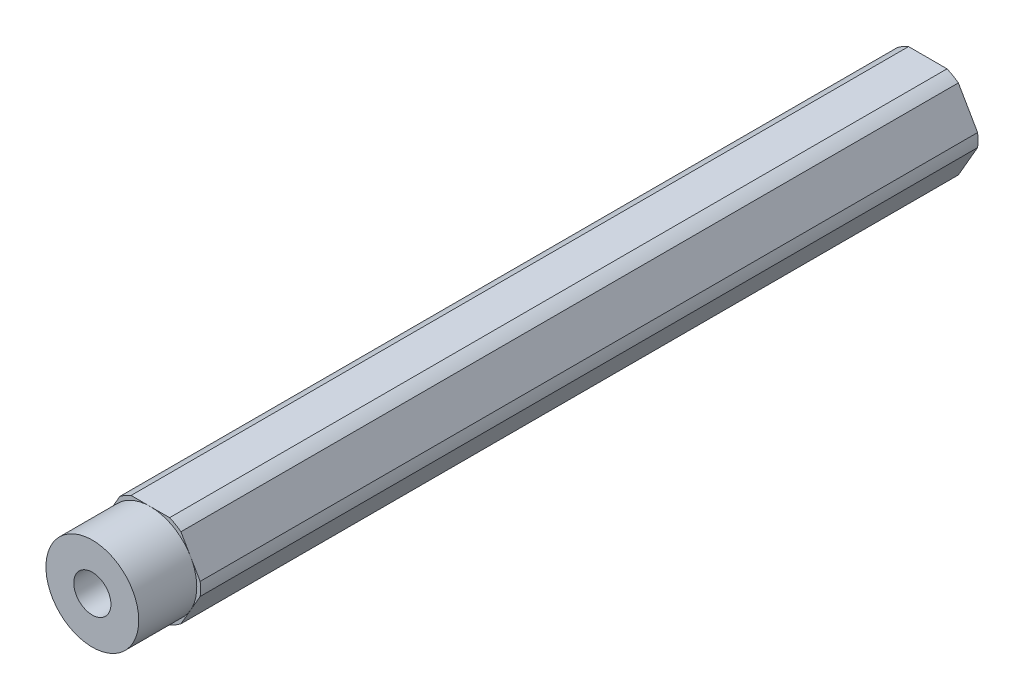
ISO-10303-21;
HEADER;
FILE_DESCRIPTION(('STEP AP214'),'2;1');
FILE_NAME('part.step','',(''),(''),'','','');
FILE_SCHEMA(('AUTOMOTIVE_DESIGN { 1 0 10303 214 1 1 1 1 }'));
ENDSEC;
DATA;
#1=APPLICATION_CONTEXT('core data for automotive mechanical design processes');
#2=APPLICATION_PROTOCOL_DEFINITION('international standard','automotive_design',2000,#1);
#3=PRODUCT_CONTEXT('',#1,'mechanical');
#4=PRODUCT('Part','Part','',(#3));
#5=PRODUCT_RELATED_PRODUCT_CATEGORY('part','',(#4));
#6=PRODUCT_DEFINITION_FORMATION('','',#4);
#7=PRODUCT_DEFINITION_CONTEXT('part definition',#1,'design');
#8=PRODUCT_DEFINITION('design','',#6,#7);
#9=PRODUCT_DEFINITION_SHAPE('','',#8);
#10=(LENGTH_UNIT() NAMED_UNIT(*) SI_UNIT(.MILLI.,.METRE.));
#11=(NAMED_UNIT(*) PLANE_ANGLE_UNIT() SI_UNIT($,.RADIAN.));
#12=(NAMED_UNIT(*) SI_UNIT($,.STERADIAN.) SOLID_ANGLE_UNIT());
#13=UNCERTAINTY_MEASURE_WITH_UNIT(LENGTH_MEASURE(1.E-05),#10,'distance_accuracy_value','');
#14=(GEOMETRIC_REPRESENTATION_CONTEXT(3) GLOBAL_UNCERTAINTY_ASSIGNED_CONTEXT((#13)) GLOBAL_UNIT_ASSIGNED_CONTEXT((#10,
#11,#12)) REPRESENTATION_CONTEXT('',''));
#15=CARTESIAN_POINT('',(0.,0.,0.));
#16=DIRECTION('',(0.,0.,1.));
#17=DIRECTION('',(1.,0.,0.));
#18=AXIS2_PLACEMENT_3D('',#15,#16,#17);
#19=CARTESIAN_POINT('',(0.,0.,114.3));
#20=DIRECTION('',(0.,0.,1.));
#21=DIRECTION('',(1.,0.,0.));
#22=AXIS2_PLACEMENT_3D('',#19,#20,#21);
#23=PLANE('',#22);
#24=CARTESIAN_POINT('',(0.,0.,114.3));
#25=DIRECTION('',(0.,0.,1.));
#26=DIRECTION('',(1.,0.,0.));
#27=AXIS2_PLACEMENT_3D('',#24,#25,#26);
#28=CIRCLE('',#27,2.54);
#29=CARTESIAN_POINT('',(2.54,0.,114.3));
#30=VERTEX_POINT('',#29);
#31=EDGE_CURVE('E178',#30,#30,#28,.T.);
#32=ORIENTED_EDGE('',*,*,#31,.F.);
#33=EDGE_LOOP('',(#32));
#34=FACE_BOUND('',#33,.T.);
#35=CARTESIAN_POINT('',(0.,0.,114.3));
#36=DIRECTION('',(0.,0.,1.));
#37=DIRECTION('',(1.,0.,0.));
#38=AXIS2_PLACEMENT_3D('',#35,#36,#37);
#39=CIRCLE('',#38,6.35);
#40=CARTESIAN_POINT('',(6.35,0.,114.3));
#41=VERTEX_POINT('',#40);
#42=EDGE_CURVE('E275',#41,#41,#39,.T.);
#43=ORIENTED_EDGE('',*,*,#42,.T.);
#44=EDGE_LOOP('',(#43));
#45=FACE_BOUND('',#44,.T.);
#46=ADVANCED_FACE('F34',(#34,#45),#23,.T.);
#47=CARTESIAN_POINT('',(0.,0.,114.3));
#48=DIRECTION('',(0.,0.,-1.));
#49=DIRECTION('',(-1.,0.,0.));
#50=AXIS2_PLACEMENT_3D('',#47,#48,#49);
#51=CYLINDRICAL_SURFACE('',#50,6.875);
#52=CARTESIAN_POINT('',(0.,0.,106.3625));
#53=DIRECTION('',(0.,0.,1.));
#54=DIRECTION('',(1.,0.,0.));
#55=AXIS2_PLACEMENT_3D('',#52,#53,#54);
#56=CIRCLE('',#55,6.875);
#57=CARTESIAN_POINT('',(4.18177080173139,5.4569605057932,106.3625));
#58=VERTEX_POINT('',#57);
#59=CARTESIAN_POINT('',(2.6349810245996,6.35,106.3625));
#60=VERTEX_POINT('',#59);
#61=EDGE_CURVE('E144',#58,#60,#56,.T.);
#62=ORIENTED_EDGE('',*,*,#61,.F.);
#63=DIRECTION('',(0.,0.,-1.));
#64=VECTOR('',#63,1.);
#65=CARTESIAN_POINT('',(4.18177080173138,5.45696050579321,114.3));
#66=LINE('',#65,#64);
#67=CARTESIAN_POINT('',(4.18177080173138,5.45696050579321,0.));
#68=VERTEX_POINT('',#67);
#69=EDGE_CURVE('E57',#58,#68,#66,.T.);
#70=ORIENTED_EDGE('',*,*,#69,.T.);
#71=CARTESIAN_POINT('',(0.,0.,0.));
#72=DIRECTION('',(0.,0.,1.));
#73=DIRECTION('',(1.,0.,0.));
#74=AXIS2_PLACEMENT_3D('',#71,#72,#73);
#75=CIRCLE('',#74,6.875);
#76=CARTESIAN_POINT('',(2.6349810245996,6.35,0.));
#77=VERTEX_POINT('',#76);
#78=EDGE_CURVE('E181',#68,#77,#75,.T.);
#79=ORIENTED_EDGE('',*,*,#78,.T.);
#80=DIRECTION('',(0.,0.,-1.));
#81=VECTOR('',#80,1.);
#82=CARTESIAN_POINT('',(2.6349810245996,6.35,114.3));
#83=LINE('',#82,#81);
#84=EDGE_CURVE('E235',#60,#77,#83,.T.);
#85=ORIENTED_EDGE('',*,*,#84,.F.);
#86=EDGE_LOOP('',(#62,#70,#79,#85));
#87=FACE_BOUND('',#86,.T.);
#88=ADVANCED_FACE('F36',(#87),#51,.T.);
#89=CARTESIAN_POINT('',(2.6349810245996,6.35,114.3));
#90=DIRECTION('',(0.,-1.,0.));
#91=DIRECTION('',(0.,0.,-1.));
#92=AXIS2_PLACEMENT_3D('',#89,#90,#91);
#93=PLANE('',#92);
#94=DIRECTION('',(-1.,0.,0.));
#95=VECTOR('',#94,1.);
#96=CARTESIAN_POINT('',(2.6349810245996,6.35,106.3625));
#97=LINE('',#96,#95);
#98=CARTESIAN_POINT('',(0.,6.35,106.3625));
#99=VERTEX_POINT('',#98);
#100=EDGE_CURVE('E141',#60,#99,#97,.T.);
#101=ORIENTED_EDGE('',*,*,#100,.F.);
#102=ORIENTED_EDGE('',*,*,#84,.T.);
#103=DIRECTION('',(-1.,0.,0.));
#104=VECTOR('',#103,1.);
#105=CARTESIAN_POINT('',(2.6349810245996,6.35,0.));
#106=LINE('',#105,#104);
#107=CARTESIAN_POINT('',(-2.6349810245996,6.35,0.));
#108=VERTEX_POINT('',#107);
#109=EDGE_CURVE('E185',#77,#108,#106,.T.);
#110=ORIENTED_EDGE('',*,*,#109,.T.);
#111=DIRECTION('',(0.,0.,-1.));
#112=VECTOR('',#111,1.);
#113=CARTESIAN_POINT('',(-2.6349810245996,6.35,114.3));
#114=LINE('',#113,#112);
#115=CARTESIAN_POINT('',(-2.6349810245996,6.35,106.3625));
#116=VERTEX_POINT('',#115);
#117=EDGE_CURVE('E171',#116,#108,#114,.T.);
#118=ORIENTED_EDGE('',*,*,#117,.F.);
#119=EDGE_CURVE('E148',#99,#116,#97,.T.);
#120=ORIENTED_EDGE('',*,*,#119,.F.);
#121=EDGE_LOOP('',(#101,#102,#110,#118,#120));
#122=FACE_BOUND('',#121,.T.);
#123=ADVANCED_FACE('F169',(#122),#93,.F.);
#124=CARTESIAN_POINT('',(0.,0.,114.3));
#125=DIRECTION('',(0.,0.,-1.));
#126=DIRECTION('',(-1.,0.,0.));
#127=AXIS2_PLACEMENT_3D('',#124,#125,#126);
#128=CYLINDRICAL_SURFACE('',#127,6.875);
#129=CARTESIAN_POINT('',(0.,0.,106.3625));
#130=DIRECTION('',(0.,0.,1.));
#131=DIRECTION('',(1.,0.,0.));
#132=AXIS2_PLACEMENT_3D('',#129,#130,#131);
#133=CIRCLE('',#132,6.875);
#134=CARTESIAN_POINT('',(-4.18177080173139,5.4569605057932,106.3625));
#135=VERTEX_POINT('',#134);
#136=EDGE_CURVE('E172',#116,#135,#133,.T.);
#137=ORIENTED_EDGE('',*,*,#136,.F.);
#138=ORIENTED_EDGE('',*,*,#117,.T.);
#139=CARTESIAN_POINT('',(0.,0.,0.));
#140=DIRECTION('',(0.,0.,1.));
#141=DIRECTION('',(1.,0.,0.));
#142=AXIS2_PLACEMENT_3D('',#139,#140,#141);
#143=CIRCLE('',#142,6.875);
#144=CARTESIAN_POINT('',(-4.18177080173139,5.4569605057932,0.));
#145=VERTEX_POINT('',#144);
#146=EDGE_CURVE('E187',#108,#145,#143,.T.);
#147=ORIENTED_EDGE('',*,*,#146,.T.);
#148=DIRECTION('',(0.,0.,-1.));
#149=VECTOR('',#148,1.);
#150=CARTESIAN_POINT('',(-4.18177080173139,5.4569605057932,114.3));
#151=LINE('',#150,#149);
#152=EDGE_CURVE('E233',#135,#145,#151,.T.);
#153=ORIENTED_EDGE('',*,*,#152,.F.);
#154=EDGE_LOOP('',(#137,#138,#147,#153));
#155=FACE_BOUND('',#154,.T.);
#156=ADVANCED_FACE('F253',(#155),#128,.T.);
#157=CARTESIAN_POINT('',(-4.18177080173139,5.4569605057932,114.3));
#158=DIRECTION('',(0.866025403784438,-0.5,0.));
#159=DIRECTION('',(0.5,0.866025403784439,0.));
#160=AXIS2_PLACEMENT_3D('',#157,#158,#159);
#161=PLANE('',#160);
#162=DIRECTION('',(-0.5,-0.866025403784439,0.));
#163=VECTOR('',#162,1.);
#164=CARTESIAN_POINT('',(-4.18177080173139,5.4569605057932,106.3625));
#165=LINE('',#164,#163);
#166=CARTESIAN_POINT('',(-5.49926131403118,3.175,106.3625));
#167=VERTEX_POINT('',#166);
#168=EDGE_CURVE('E156',#135,#167,#165,.T.);
#169=ORIENTED_EDGE('',*,*,#168,.F.);
#170=ORIENTED_EDGE('',*,*,#152,.T.);
#171=DIRECTION('',(-0.5,-0.866025403784438,0.));
#172=VECTOR('',#171,1.);
#173=CARTESIAN_POINT('',(-4.18177080173139,5.4569605057932,0.));
#174=LINE('',#173,#172);
#175=CARTESIAN_POINT('',(-6.81675182633099,0.893039494206804,0.));
#176=VERTEX_POINT('',#175);
#177=EDGE_CURVE('E190',#145,#176,#174,.T.);
#178=ORIENTED_EDGE('',*,*,#177,.T.);
#179=DIRECTION('',(0.,0.,-1.));
#180=VECTOR('',#179,1.);
#181=CARTESIAN_POINT('',(-6.81675182633099,0.893039494206804,114.3));
#182=LINE('',#181,#180);
#183=CARTESIAN_POINT('',(-6.81675182633099,0.893039494206804,106.3625));
#184=VERTEX_POINT('',#183);
#185=EDGE_CURVE('E231',#184,#176,#182,.T.);
#186=ORIENTED_EDGE('',*,*,#185,.F.);
#187=EDGE_CURVE('E257',#167,#184,#165,.T.);
#188=ORIENTED_EDGE('',*,*,#187,.F.);
#189=EDGE_LOOP('',(#169,#170,#178,#186,#188));
#190=FACE_BOUND('',#189,.T.);
#191=ADVANCED_FACE('F255',(#190),#161,.F.);
#192=CARTESIAN_POINT('',(0.,0.,114.3));
#193=DIRECTION('',(0.,0.,-1.));
#194=DIRECTION('',(-1.,0.,0.));
#195=AXIS2_PLACEMENT_3D('',#192,#193,#194);
#196=CYLINDRICAL_SURFACE('',#195,6.875);
#197=CARTESIAN_POINT('',(0.,0.,106.3625));
#198=DIRECTION('',(0.,0.,1.));
#199=DIRECTION('',(1.,0.,0.));
#200=AXIS2_PLACEMENT_3D('',#197,#198,#199);
#201=CIRCLE('',#200,6.875);
#202=CARTESIAN_POINT('',(-6.81675182633099,-0.893039494206803,106.3625));
#203=VERTEX_POINT('',#202);
#204=EDGE_CURVE('E258',#184,#203,#201,.T.);
#205=ORIENTED_EDGE('',*,*,#204,.F.);
#206=ORIENTED_EDGE('',*,*,#185,.T.);
#207=CARTESIAN_POINT('',(0.,0.,0.));
#208=DIRECTION('',(0.,0.,1.));
#209=DIRECTION('',(1.,0.,0.));
#210=AXIS2_PLACEMENT_3D('',#207,#208,#209);
#211=CIRCLE('',#210,6.875);
#212=CARTESIAN_POINT('',(-6.81675182633099,-0.893039494206803,0.));
#213=VERTEX_POINT('',#212);
#214=EDGE_CURVE('E193',#176,#213,#211,.T.);
#215=ORIENTED_EDGE('',*,*,#214,.T.);
#216=DIRECTION('',(0.,0.,-1.));
#217=VECTOR('',#216,1.);
#218=CARTESIAN_POINT('',(-6.81675182633099,-0.893039494206803,114.3));
#219=LINE('',#218,#217);
#220=EDGE_CURVE('E229',#203,#213,#219,.T.);
#221=ORIENTED_EDGE('',*,*,#220,.F.);
#222=EDGE_LOOP('',(#205,#206,#215,#221));
#223=FACE_BOUND('',#222,.T.);
#224=ADVANCED_FACE('F446',(#223),#196,.T.);
#225=CARTESIAN_POINT('',(-6.81675182633099,-0.893039494206804,114.3));
#226=DIRECTION('',(0.866025403784439,0.5,0.));
#227=DIRECTION('',(-0.5,0.866025403784439,0.));
#228=AXIS2_PLACEMENT_3D('',#225,#226,#227);
#229=PLANE('',#228);
#230=DIRECTION('',(0.5,-0.866025403784439,0.));
#231=VECTOR('',#230,1.);
#232=CARTESIAN_POINT('',(-6.81675182633099,-0.893039494206804,106.3625));
#233=LINE('',#232,#231);
#234=CARTESIAN_POINT('',(-5.49926131403119,-3.175,106.3625));
#235=VERTEX_POINT('',#234);
#236=EDGE_CURVE('E261',#203,#235,#233,.T.);
#237=ORIENTED_EDGE('',*,*,#236,.F.);
#238=ORIENTED_EDGE('',*,*,#220,.T.);
#239=DIRECTION('',(0.5,-0.866025403784439,0.));
#240=VECTOR('',#239,1.);
#241=CARTESIAN_POINT('',(-6.81675182633099,-0.893039494206804,0.));
#242=LINE('',#241,#240);
#243=CARTESIAN_POINT('',(-4.18177080173139,-5.4569605057932,0.));
#244=VERTEX_POINT('',#243);
#245=EDGE_CURVE('E196',#213,#244,#242,.T.);
#246=ORIENTED_EDGE('',*,*,#245,.T.);
#247=DIRECTION('',(0.,0.,-1.));
#248=VECTOR('',#247,1.);
#249=CARTESIAN_POINT('',(-4.18177080173139,-5.4569605057932,114.3));
#250=LINE('',#249,#248);
#251=CARTESIAN_POINT('',(-4.18177080173139,-5.4569605057932,106.3625));
#252=VERTEX_POINT('',#251);
#253=EDGE_CURVE('E227',#252,#244,#250,.T.);
#254=ORIENTED_EDGE('',*,*,#253,.F.);
#255=EDGE_CURVE('E262',#235,#252,#233,.T.);
#256=ORIENTED_EDGE('',*,*,#255,.F.);
#257=EDGE_LOOP('',(#237,#238,#246,#254,#256));
#258=FACE_BOUND('',#257,.T.);
#259=ADVANCED_FACE('F291',(#258),#229,.F.);
#260=CARTESIAN_POINT('',(0.,0.,114.3));
#261=DIRECTION('',(0.,0.,-1.));
#262=DIRECTION('',(-1.,0.,0.));
#263=AXIS2_PLACEMENT_3D('',#260,#261,#262);
#264=CYLINDRICAL_SURFACE('',#263,6.875);
#265=CARTESIAN_POINT('',(0.,0.,106.3625));
#266=DIRECTION('',(0.,0.,1.));
#267=DIRECTION('',(1.,0.,0.));
#268=AXIS2_PLACEMENT_3D('',#265,#266,#267);
#269=CIRCLE('',#268,6.875);
#270=CARTESIAN_POINT('',(-2.6349810245996,-6.35,106.3625));
#271=VERTEX_POINT('',#270);
#272=EDGE_CURVE('E264',#252,#271,#269,.T.);
#273=ORIENTED_EDGE('',*,*,#272,.F.);
#274=ORIENTED_EDGE('',*,*,#253,.T.);
#275=CARTESIAN_POINT('',(0.,0.,0.));
#276=DIRECTION('',(0.,0.,1.));
#277=DIRECTION('',(1.,0.,0.));
#278=AXIS2_PLACEMENT_3D('',#275,#276,#277);
#279=CIRCLE('',#278,6.875);
#280=CARTESIAN_POINT('',(-2.6349810245996,-6.35,0.));
#281=VERTEX_POINT('',#280);
#282=EDGE_CURVE('E199',#244,#281,#279,.T.);
#283=ORIENTED_EDGE('',*,*,#282,.T.);
#284=DIRECTION('',(0.,0.,-1.));
#285=VECTOR('',#284,1.);
#286=CARTESIAN_POINT('',(-2.6349810245996,-6.35,114.3));
#287=LINE('',#286,#285);
#288=EDGE_CURVE('E225',#271,#281,#287,.T.);
#289=ORIENTED_EDGE('',*,*,#288,.F.);
#290=EDGE_LOOP('',(#273,#274,#283,#289));
#291=FACE_BOUND('',#290,.T.);
#292=ADVANCED_FACE('F299',(#291),#264,.T.);
#293=CARTESIAN_POINT('',(-2.6349810245996,-6.35,114.3));
#294=DIRECTION('',(0.,1.,0.));
#295=DIRECTION('',(-1.,0.,0.));
#296=AXIS2_PLACEMENT_3D('',#293,#294,#295);
#297=PLANE('',#296);
#298=DIRECTION('',(1.,0.,0.));
#299=VECTOR('',#298,1.);
#300=CARTESIAN_POINT('',(-2.6349810245996,-6.35,106.3625));
#301=LINE('',#300,#299);
#302=CARTESIAN_POINT('',(0.,-6.35,106.3625));
#303=VERTEX_POINT('',#302);
#304=EDGE_CURVE('E266',#271,#303,#301,.T.);
#305=ORIENTED_EDGE('',*,*,#304,.F.);
#306=ORIENTED_EDGE('',*,*,#288,.T.);
#307=DIRECTION('',(1.,0.,0.));
#308=VECTOR('',#307,1.);
#309=CARTESIAN_POINT('',(-2.6349810245996,-6.35,0.));
#310=LINE('',#309,#308);
#311=CARTESIAN_POINT('',(2.6349810245996,-6.35,0.));
#312=VERTEX_POINT('',#311);
#313=EDGE_CURVE('E202',#281,#312,#310,.T.);
#314=ORIENTED_EDGE('',*,*,#313,.T.);
#315=DIRECTION('',(0.,0.,-1.));
#316=VECTOR('',#315,1.);
#317=CARTESIAN_POINT('',(2.6349810245996,-6.35,114.3));
#318=LINE('',#317,#316);
#319=CARTESIAN_POINT('',(2.6349810245996,-6.35,106.3625));
#320=VERTEX_POINT('',#319);
#321=EDGE_CURVE('E223',#320,#312,#318,.T.);
#322=ORIENTED_EDGE('',*,*,#321,.F.);
#323=EDGE_CURVE('E267',#303,#320,#301,.T.);
#324=ORIENTED_EDGE('',*,*,#323,.F.);
#325=EDGE_LOOP('',(#305,#306,#314,#322,#324));
#326=FACE_BOUND('',#325,.T.);
#327=ADVANCED_FACE('F303',(#326),#297,.F.);
#328=CARTESIAN_POINT('',(0.,0.,114.3));
#329=DIRECTION('',(0.,0.,-1.));
#330=DIRECTION('',(-1.,0.,0.));
#331=AXIS2_PLACEMENT_3D('',#328,#329,#330);
#332=CYLINDRICAL_SURFACE('',#331,6.875);
#333=CARTESIAN_POINT('',(0.,0.,106.3625));
#334=DIRECTION('',(0.,0.,1.));
#335=DIRECTION('',(1.,0.,0.));
#336=AXIS2_PLACEMENT_3D('',#333,#334,#335);
#337=CIRCLE('',#336,6.875);
#338=CARTESIAN_POINT('',(4.18177080173138,-5.45696050579321,106.3625));
#339=VERTEX_POINT('',#338);
#340=EDGE_CURVE('E269',#320,#339,#337,.T.);
#341=ORIENTED_EDGE('',*,*,#340,.F.);
#342=ORIENTED_EDGE('',*,*,#321,.T.);
#343=CARTESIAN_POINT('',(0.,0.,0.));
#344=DIRECTION('',(0.,0.,1.));
#345=DIRECTION('',(1.,0.,0.));
#346=AXIS2_PLACEMENT_3D('',#343,#344,#345);
#347=CIRCLE('',#346,6.875);
#348=CARTESIAN_POINT('',(4.18177080173138,-5.45696050579321,0.));
#349=VERTEX_POINT('',#348);
#350=EDGE_CURVE('E205',#312,#349,#347,.T.);
#351=ORIENTED_EDGE('',*,*,#350,.T.);
#352=DIRECTION('',(0.,0.,-1.));
#353=VECTOR('',#352,1.);
#354=CARTESIAN_POINT('',(4.18177080173138,-5.45696050579321,114.3));
#355=LINE('',#354,#353);
#356=EDGE_CURVE('E221',#339,#349,#355,.T.);
#357=ORIENTED_EDGE('',*,*,#356,.F.);
#358=EDGE_LOOP('',(#341,#342,#351,#357));
#359=FACE_BOUND('',#358,.T.);
#360=ADVANCED_FACE('F321',(#359),#332,.T.);
#361=CARTESIAN_POINT('',(4.18177080173138,-5.45696050579321,114.3));
#362=DIRECTION('',(-0.866025403784438,0.500000000000001,0.));
#363=DIRECTION('',(-0.500000000000001,-0.866025403784438,0.));
#364=AXIS2_PLACEMENT_3D('',#361,#362,#363);
#365=PLANE('',#364);
#366=DIRECTION('',(0.500000000000001,0.866025403784438,0.));
#367=VECTOR('',#366,1.);
#368=CARTESIAN_POINT('',(4.18177080173138,-5.45696050579321,106.3625));
#369=LINE('',#368,#367);
#370=CARTESIAN_POINT('',(5.49926131403118,-3.175,106.3625));
#371=VERTEX_POINT('',#370);
#372=EDGE_CURVE('E271',#339,#371,#369,.T.);
#373=ORIENTED_EDGE('',*,*,#372,.F.);
#374=ORIENTED_EDGE('',*,*,#356,.T.);
#375=DIRECTION('',(0.500000000000001,0.866025403784438,0.));
#376=VECTOR('',#375,1.);
#377=CARTESIAN_POINT('',(4.18177080173138,-5.45696050579321,0.));
#378=LINE('',#377,#376);
#379=CARTESIAN_POINT('',(6.81675182633099,-0.893039494206801,0.));
#380=VERTEX_POINT('',#379);
#381=EDGE_CURVE('E208',#349,#380,#378,.T.);
#382=ORIENTED_EDGE('',*,*,#381,.T.);
#383=DIRECTION('',(0.,0.,-1.));
#384=VECTOR('',#383,1.);
#385=CARTESIAN_POINT('',(6.81675182633099,-0.893039494206801,114.3));
#386=LINE('',#385,#384);
#387=CARTESIAN_POINT('',(6.81675182633099,-0.893039494206801,106.3625));
#388=VERTEX_POINT('',#387);
#389=EDGE_CURVE('E219',#388,#380,#386,.T.);
#390=ORIENTED_EDGE('',*,*,#389,.F.);
#391=EDGE_CURVE('E272',#371,#388,#369,.T.);
#392=ORIENTED_EDGE('',*,*,#391,.F.);
#393=EDGE_LOOP('',(#373,#374,#382,#390,#392));
#394=FACE_BOUND('',#393,.T.);
#395=ADVANCED_FACE('F319',(#394),#365,.F.);
#396=CARTESIAN_POINT('',(0.,0.,114.3));
#397=DIRECTION('',(0.,0.,-1.));
#398=DIRECTION('',(-1.,0.,0.));
#399=AXIS2_PLACEMENT_3D('',#396,#397,#398);
#400=CYLINDRICAL_SURFACE('',#399,6.875);
#401=CARTESIAN_POINT('',(0.,0.,106.3625));
#402=DIRECTION('',(0.,0.,1.));
#403=DIRECTION('',(1.,0.,0.));
#404=AXIS2_PLACEMENT_3D('',#401,#402,#403);
#405=CIRCLE('',#404,6.875);
#406=CARTESIAN_POINT('',(6.81675182633099,0.893039494206792,106.3625));
#407=VERTEX_POINT('',#406);
#408=EDGE_CURVE('E167',#388,#407,#405,.T.);
#409=ORIENTED_EDGE('',*,*,#408,.F.);
#410=ORIENTED_EDGE('',*,*,#389,.T.);
#411=CARTESIAN_POINT('',(0.,0.,0.));
#412=DIRECTION('',(0.,0.,1.));
#413=DIRECTION('',(1.,0.,0.));
#414=AXIS2_PLACEMENT_3D('',#411,#412,#413);
#415=CIRCLE('',#414,6.875);
#416=CARTESIAN_POINT('',(6.81675182633099,0.893039494206792,0.));
#417=VERTEX_POINT('',#416);
#418=EDGE_CURVE('E211',#380,#417,#415,.T.);
#419=ORIENTED_EDGE('',*,*,#418,.T.);
#420=DIRECTION('',(0.,0.,-1.));
#421=VECTOR('',#420,1.);
#422=CARTESIAN_POINT('',(6.81675182633099,0.893039494206792,114.3));
#423=LINE('',#422,#421);
#424=EDGE_CURVE('E217',#407,#417,#423,.T.);
#425=ORIENTED_EDGE('',*,*,#424,.F.);
#426=EDGE_LOOP('',(#409,#410,#419,#425));
#427=FACE_BOUND('',#426,.T.);
#428=ADVANCED_FACE('F316',(#427),#400,.T.);
#429=CARTESIAN_POINT('',(6.81675182633099,0.893039494206795,114.3));
#430=DIRECTION('',(-0.866025403784439,-0.5,0.));
#431=DIRECTION('',(0.5,-0.866025403784439,0.));
#432=AXIS2_PLACEMENT_3D('',#429,#430,#431);
#433=PLANE('',#432);
#434=DIRECTION('',(-0.5,0.866025403784439,0.));
#435=VECTOR('',#434,1.);
#436=CARTESIAN_POINT('',(6.81675182633099,0.893039494206795,106.3625));
#437=LINE('',#436,#435);
#438=CARTESIAN_POINT('',(5.49926131403118,3.175,106.3625));
#439=VERTEX_POINT('',#438);
#440=EDGE_CURVE('E12',#407,#439,#437,.T.);
#441=ORIENTED_EDGE('',*,*,#440,.F.);
#442=ORIENTED_EDGE('',*,*,#424,.T.);
#443=DIRECTION('',(-0.5,0.866025403784439,0.));
#444=VECTOR('',#443,1.);
#445=CARTESIAN_POINT('',(6.81675182633099,0.893039494206795,0.));
#446=LINE('',#445,#444);
#447=EDGE_CURVE('E214',#417,#68,#446,.T.);
#448=ORIENTED_EDGE('',*,*,#447,.T.);
#449=ORIENTED_EDGE('',*,*,#69,.F.);
#450=EDGE_CURVE('E38',#439,#58,#437,.T.);
#451=ORIENTED_EDGE('',*,*,#450,.F.);
#452=EDGE_LOOP('',(#441,#442,#448,#449,#451));
#453=FACE_BOUND('',#452,.T.);
#454=ADVANCED_FACE('F240',(#453),#433,.F.);
#455=CARTESIAN_POINT('',(0.,0.,0.));
#456=DIRECTION('',(0.,0.,1.));
#457=DIRECTION('',(1.,0.,0.));
#458=AXIS2_PLACEMENT_3D('',#455,#456,#457);
#459=PLANE('',#458);
#460=ORIENTED_EDGE('',*,*,#78,.F.);
#461=ORIENTED_EDGE('',*,*,#447,.F.);
#462=ORIENTED_EDGE('',*,*,#418,.F.);
#463=ORIENTED_EDGE('',*,*,#381,.F.);
#464=ORIENTED_EDGE('',*,*,#350,.F.);
#465=ORIENTED_EDGE('',*,*,#313,.F.);
#466=ORIENTED_EDGE('',*,*,#282,.F.);
#467=ORIENTED_EDGE('',*,*,#245,.F.);
#468=ORIENTED_EDGE('',*,*,#214,.F.);
#469=ORIENTED_EDGE('',*,*,#177,.F.);
#470=ORIENTED_EDGE('',*,*,#146,.F.);
#471=ORIENTED_EDGE('',*,*,#109,.F.);
#472=EDGE_LOOP('',(#460,#461,#462,#463,#464,#465,#466,#467,#468,#469,#470,#471));
#473=FACE_BOUND('',#472,.T.);
#474=CARTESIAN_POINT('',(0.,0.,0.));
#475=DIRECTION('',(0.,0.,1.));
#476=DIRECTION('',(1.,0.,0.));
#477=AXIS2_PLACEMENT_3D('',#474,#475,#476);
#478=CIRCLE('',#477,2.54);
#479=CARTESIAN_POINT('',(2.54,0.,0.));
#480=VERTEX_POINT('',#479);
#481=EDGE_CURVE('E177',#480,#480,#478,.T.);
#482=ORIENTED_EDGE('',*,*,#481,.T.);
#483=EDGE_LOOP('',(#482));
#484=FACE_BOUND('',#483,.T.);
#485=ADVANCED_FACE('F246',(#473,#484),#459,.F.);
#486=CARTESIAN_POINT('',(0.,0.,114.3));
#487=DIRECTION('',(0.,0.,-1.));
#488=DIRECTION('',(-1.,0.,0.));
#489=AXIS2_PLACEMENT_3D('',#486,#487,#488);
#490=CYLINDRICAL_SURFACE('',#489,2.54);
#491=ORIENTED_EDGE('',*,*,#31,.T.);
#492=EDGE_LOOP('',(#491));
#493=FACE_BOUND('',#492,.T.);
#494=ORIENTED_EDGE('',*,*,#481,.F.);
#495=EDGE_LOOP('',(#494));
#496=FACE_BOUND('',#495,.T.);
#497=ADVANCED_FACE('F339',(#493,#496),#490,.F.);
#498=CARTESIAN_POINT('',(0.,0.,106.3625));
#499=DIRECTION('',(0.,0.,1.));
#500=DIRECTION('',(1.,0.,0.));
#501=AXIS2_PLACEMENT_3D('',#498,#499,#500);
#502=PLANE('',#501);
#503=ORIENTED_EDGE('',*,*,#61,.T.);
#504=ORIENTED_EDGE('',*,*,#100,.T.);
#505=CARTESIAN_POINT('',(0.,0.,106.3625));
#506=DIRECTION('',(0.,0.,1.));
#507=DIRECTION('',(1.,0.,0.));
#508=AXIS2_PLACEMENT_3D('',#505,#506,#507);
#509=CIRCLE('',#508,6.35);
#510=EDGE_CURVE('E49',#439,#99,#509,.T.);
#511=ORIENTED_EDGE('',*,*,#510,.F.);
#512=ORIENTED_EDGE('',*,*,#450,.T.);
#513=EDGE_LOOP('',(#503,#504,#511,#512));
#514=FACE_BOUND('',#513,.T.);
#515=ADVANCED_FACE('F143',(#514),#502,.T.);
#516=ORIENTED_EDGE('',*,*,#119,.T.);
#517=ORIENTED_EDGE('',*,*,#136,.T.);
#518=ORIENTED_EDGE('',*,*,#168,.T.);
#519=EDGE_CURVE('E152',#99,#167,#509,.T.);
#520=ORIENTED_EDGE('',*,*,#519,.F.);
#521=EDGE_LOOP('',(#516,#517,#518,#520));
#522=FACE_BOUND('',#521,.T.);
#523=ADVANCED_FACE('F153',(#522),#502,.T.);
#524=ORIENTED_EDGE('',*,*,#187,.T.);
#525=ORIENTED_EDGE('',*,*,#204,.T.);
#526=ORIENTED_EDGE('',*,*,#236,.T.);
#527=EDGE_CURVE('E161',#167,#235,#509,.T.);
#528=ORIENTED_EDGE('',*,*,#527,.F.);
#529=EDGE_LOOP('',(#524,#525,#526,#528));
#530=FACE_BOUND('',#529,.T.);
#531=ADVANCED_FACE('F375',(#530),#502,.T.);
#532=ORIENTED_EDGE('',*,*,#255,.T.);
#533=ORIENTED_EDGE('',*,*,#272,.T.);
#534=ORIENTED_EDGE('',*,*,#304,.T.);
#535=EDGE_CURVE('E280',#235,#303,#509,.T.);
#536=ORIENTED_EDGE('',*,*,#535,.F.);
#537=EDGE_LOOP('',(#532,#533,#534,#536));
#538=FACE_BOUND('',#537,.T.);
#539=ADVANCED_FACE('F295',(#538),#502,.T.);
#540=ORIENTED_EDGE('',*,*,#323,.T.);
#541=ORIENTED_EDGE('',*,*,#340,.T.);
#542=ORIENTED_EDGE('',*,*,#372,.T.);
#543=EDGE_CURVE('E279',#303,#371,#509,.T.);
#544=ORIENTED_EDGE('',*,*,#543,.F.);
#545=EDGE_LOOP('',(#540,#541,#542,#544));
#546=FACE_BOUND('',#545,.T.);
#547=ADVANCED_FACE('F307',(#546),#502,.T.);
#548=ORIENTED_EDGE('',*,*,#391,.T.);
#549=ORIENTED_EDGE('',*,*,#408,.T.);
#550=ORIENTED_EDGE('',*,*,#440,.T.);
#551=EDGE_CURVE('E166',#371,#439,#509,.T.);
#552=ORIENTED_EDGE('',*,*,#551,.F.);
#553=EDGE_LOOP('',(#548,#549,#550,#552));
#554=FACE_BOUND('',#553,.T.);
#555=ADVANCED_FACE('F313',(#554),#502,.T.);
#556=CARTESIAN_POINT('',(0.,0.,106.3625));
#557=DIRECTION('',(0.,0.,1.));
#558=DIRECTION('',(1.,0.,0.));
#559=AXIS2_PLACEMENT_3D('',#556,#557,#558);
#560=CYLINDRICAL_SURFACE('',#559,6.35);
#561=ORIENTED_EDGE('',*,*,#42,.F.);
#562=EDGE_LOOP('',(#561));
#563=FACE_BOUND('',#562,.T.);
#564=ORIENTED_EDGE('',*,*,#510,.T.);
#565=ORIENTED_EDGE('',*,*,#519,.T.);
#566=ORIENTED_EDGE('',*,*,#527,.T.);
#567=ORIENTED_EDGE('',*,*,#535,.T.);
#568=ORIENTED_EDGE('',*,*,#543,.T.);
#569=ORIENTED_EDGE('',*,*,#551,.T.);
#570=EDGE_LOOP('',(#564,#565,#566,#567,#568,#569));
#571=FACE_BOUND('',#570,.T.);
#572=ADVANCED_FACE('F163',(#563,#571),#560,.T.);
#573=CLOSED_SHELL('',(#46,#88,#123,#156,#191,#224,#259,#292,#327,#360,#395,#428,#454,#485,#497,
#515,#523,#531,#539,#547,#555,#572));
#574=MANIFOLD_SOLID_BREP('B2',#573);
#575=ADVANCED_BREP_SHAPE_REPRESENTATION('',(#18,#574),#14);
#576=SHAPE_DEFINITION_REPRESENTATION(#9,#575);
ENDSEC;
END-ISO-10303-21;
